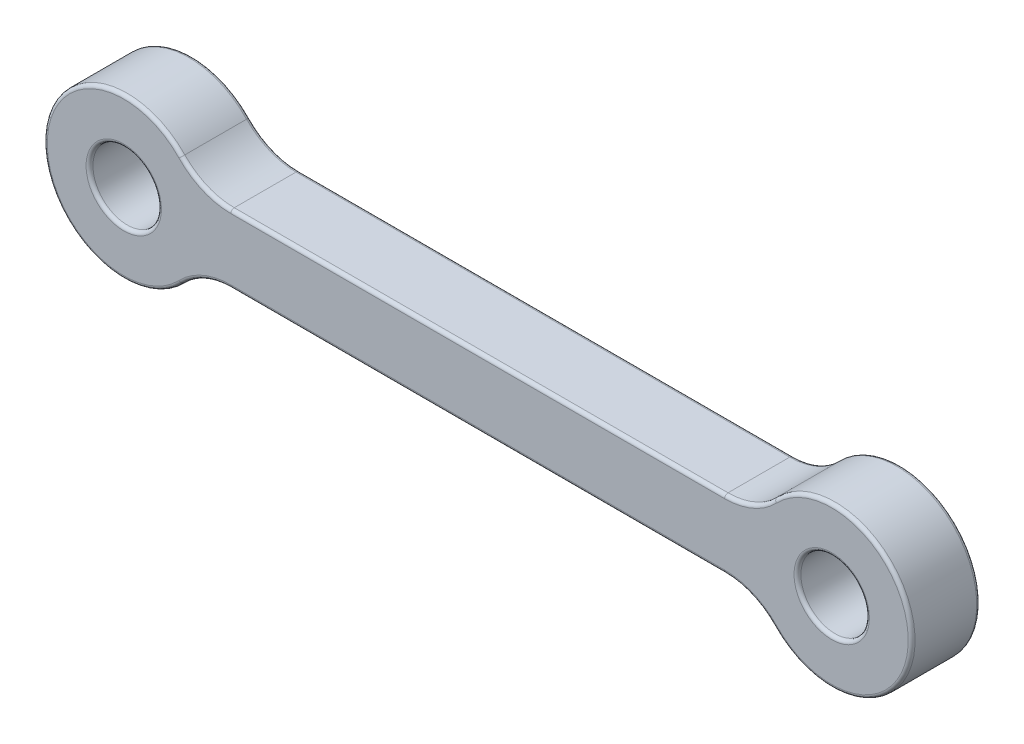
ISO-10303-21;
HEADER;
FILE_DESCRIPTION(('STEP AP214'),'2;1');
FILE_NAME('part.step','',(''),(''),'','','');
FILE_SCHEMA(('AUTOMOTIVE_DESIGN { 1 0 10303 214 1 1 1 1 }'));
ENDSEC;
DATA;
#1=APPLICATION_CONTEXT('core data for automotive mechanical design processes');
#2=APPLICATION_PROTOCOL_DEFINITION('international standard','automotive_design',2000,#1);
#3=PRODUCT_CONTEXT('',#1,'mechanical');
#4=PRODUCT('Part','Part','',(#3));
#5=PRODUCT_RELATED_PRODUCT_CATEGORY('part','',(#4));
#6=PRODUCT_DEFINITION_FORMATION('','',#4);
#7=PRODUCT_DEFINITION_CONTEXT('part definition',#1,'design');
#8=PRODUCT_DEFINITION('design','',#6,#7);
#9=PRODUCT_DEFINITION_SHAPE('','',#8);
#10=(LENGTH_UNIT() NAMED_UNIT(*) SI_UNIT(.MILLI.,.METRE.));
#11=(NAMED_UNIT(*) PLANE_ANGLE_UNIT() SI_UNIT($,.RADIAN.));
#12=(NAMED_UNIT(*) SI_UNIT($,.STERADIAN.) SOLID_ANGLE_UNIT());
#13=UNCERTAINTY_MEASURE_WITH_UNIT(LENGTH_MEASURE(1.E-05),#10,'distance_accuracy_value','');
#14=(GEOMETRIC_REPRESENTATION_CONTEXT(3) GLOBAL_UNCERTAINTY_ASSIGNED_CONTEXT((#13)) GLOBAL_UNIT_ASSIGNED_CONTEXT((#10,
#11,#12)) REPRESENTATION_CONTEXT('',''));
#15=CARTESIAN_POINT('',(0.,0.,0.));
#16=DIRECTION('',(0.,0.,1.));
#17=DIRECTION('',(1.,0.,0.));
#18=AXIS2_PLACEMENT_3D('',#15,#16,#17);
#19=CARTESIAN_POINT('',(0.,0.,1.5));
#20=DIRECTION('',(0.,0.,-1.));
#21=DIRECTION('',(-1.,0.,0.));
#22=AXIS2_PLACEMENT_3D('',#19,#20,#21);
#23=CYLINDRICAL_SURFACE('',#22,3.5);
#24=DIRECTION('',(0.,0.,-1.));
#25=VECTOR('',#24,1.);
#26=CARTESIAN_POINT('',(2.52560848605877,-2.42307692307692,1.5));
#27=LINE('',#26,#25);
#28=CARTESIAN_POINT('',(2.52560848605877,-2.42307692307692,-1.35));
#29=VERTEX_POINT('',#28);
#30=CARTESIAN_POINT('',(2.52560848605877,-2.42307692307692,1.35));
#31=VERTEX_POINT('',#30);
#32=EDGE_CURVE('E402',#29,#31,#27,.F.);
#33=ORIENTED_EDGE('',*,*,#32,.T.);
#34=CARTESIAN_POINT('',(0.,0.,1.35));
#35=DIRECTION('',(0.,0.,1.));
#36=DIRECTION('',(1.,0.,0.));
#37=AXIS2_PLACEMENT_3D('',#34,#35,#36);
#38=CIRCLE('',#37,3.5);
#39=CARTESIAN_POINT('',(2.52560848605877,2.42307692307692,1.35));
#40=VERTEX_POINT('',#39);
#41=EDGE_CURVE('E238',#31,#40,#38,.F.);
#42=ORIENTED_EDGE('',*,*,#41,.T.);
#43=DIRECTION('',(0.,0.,-1.));
#44=VECTOR('',#43,1.);
#45=CARTESIAN_POINT('',(2.52560848605877,2.42307692307692,1.5));
#46=LINE('',#45,#44);
#47=CARTESIAN_POINT('',(2.52560848605877,2.42307692307692,-1.35));
#48=VERTEX_POINT('',#47);
#49=EDGE_CURVE('E405',#40,#48,#46,.T.);
#50=ORIENTED_EDGE('',*,*,#49,.T.);
#51=CARTESIAN_POINT('',(0.,0.,-1.35));
#52=DIRECTION('',(0.,0.,1.));
#53=DIRECTION('',(1.,0.,0.));
#54=AXIS2_PLACEMENT_3D('',#51,#52,#53);
#55=CIRCLE('',#54,3.5);
#56=EDGE_CURVE('E235',#48,#29,#55,.T.);
#57=ORIENTED_EDGE('',*,*,#56,.T.);
#58=EDGE_LOOP('',(#33,#42,#50,#57));
#59=FACE_BOUND('',#58,.T.);
#60=ADVANCED_FACE('F41',(#59),#23,.T.);
#61=CARTESIAN_POINT('',(0.,-1.5,1.5));
#62=DIRECTION('',(0.,-1.,0.));
#63=DIRECTION('',(0.,0.,-1.));
#64=AXIS2_PLACEMENT_3D('',#61,#62,#63);
#65=PLANE('',#64);
#66=DIRECTION('',(0.,0.,1.));
#67=VECTOR('',#66,1.);
#68=CARTESIAN_POINT('',(26.3095842401766,-1.5,1.5));
#69=LINE('',#68,#67);
#70=CARTESIAN_POINT('',(26.3095842401766,-1.5,-1.35));
#71=VERTEX_POINT('',#70);
#72=CARTESIAN_POINT('',(26.3095842401766,-1.5,1.35));
#73=VERTEX_POINT('',#72);
#74=EDGE_CURVE('E310',#71,#73,#69,.T.);
#75=ORIENTED_EDGE('',*,*,#74,.T.);
#76=DIRECTION('',(-1.,0.,0.));
#77=VECTOR('',#76,1.);
#78=CARTESIAN_POINT('',(0.,-1.5,1.35));
#79=LINE('',#78,#77);
#80=CARTESIAN_POINT('',(4.69041575982343,-1.5,1.35));
#81=VERTEX_POINT('',#80);
#82=EDGE_CURVE('E225',#73,#81,#79,.T.);
#83=ORIENTED_EDGE('',*,*,#82,.T.);
#84=DIRECTION('',(0.,0.,-1.));
#85=VECTOR('',#84,1.);
#86=CARTESIAN_POINT('',(4.69041575982343,-1.5,1.5));
#87=LINE('',#86,#85);
#88=CARTESIAN_POINT('',(4.69041575982343,-1.5,-1.35));
#89=VERTEX_POINT('',#88);
#90=EDGE_CURVE('E411',#81,#89,#87,.T.);
#91=ORIENTED_EDGE('',*,*,#90,.T.);
#92=DIRECTION('',(-1.,0.,0.));
#93=VECTOR('',#92,1.);
#94=CARTESIAN_POINT('',(26.3095842401766,-1.5,-1.35));
#95=LINE('',#94,#93);
#96=EDGE_CURVE('E222',#89,#71,#95,.F.);
#97=ORIENTED_EDGE('',*,*,#96,.T.);
#98=EDGE_LOOP('',(#75,#83,#91,#97));
#99=FACE_BOUND('',#98,.T.);
#100=ADVANCED_FACE('F420',(#99),#65,.T.);
#101=CARTESIAN_POINT('',(31.,0.,1.5));
#102=DIRECTION('',(0.,0.,-1.));
#103=DIRECTION('',(-1.,0.,0.));
#104=AXIS2_PLACEMENT_3D('',#101,#102,#103);
#105=CYLINDRICAL_SURFACE('',#104,3.5);
#106=DIRECTION('',(0.,0.,-1.));
#107=VECTOR('',#106,1.);
#108=CARTESIAN_POINT('',(28.4743915139412,2.42307692307692,1.5));
#109=LINE('',#108,#107);
#110=CARTESIAN_POINT('',(28.4743915139412,2.42307692307692,-1.35));
#111=VERTEX_POINT('',#110);
#112=CARTESIAN_POINT('',(28.4743915139412,2.42307692307692,1.35));
#113=VERTEX_POINT('',#112);
#114=EDGE_CURVE('E358',#111,#113,#109,.F.);
#115=ORIENTED_EDGE('',*,*,#114,.T.);
#116=CARTESIAN_POINT('',(31.,0.,1.35));
#117=DIRECTION('',(0.,0.,1.));
#118=DIRECTION('',(1.,0.,0.));
#119=AXIS2_PLACEMENT_3D('',#116,#117,#118);
#120=CIRCLE('',#119,3.5);
#121=CARTESIAN_POINT('',(28.4743915139412,-2.42307692307692,1.35));
#122=VERTEX_POINT('',#121);
#123=EDGE_CURVE('E213',#113,#122,#120,.F.);
#124=ORIENTED_EDGE('',*,*,#123,.T.);
#125=DIRECTION('',(0.,0.,-1.));
#126=VECTOR('',#125,1.);
#127=CARTESIAN_POINT('',(28.4743915139412,-2.42307692307692,1.5));
#128=LINE('',#127,#126);
#129=CARTESIAN_POINT('',(28.4743915139412,-2.42307692307692,-1.35));
#130=VERTEX_POINT('',#129);
#131=EDGE_CURVE('E365',#122,#130,#128,.T.);
#132=ORIENTED_EDGE('',*,*,#131,.T.);
#133=CARTESIAN_POINT('',(31.,0.,-1.35));
#134=DIRECTION('',(0.,0.,1.));
#135=DIRECTION('',(1.,0.,0.));
#136=AXIS2_PLACEMENT_3D('',#133,#134,#135);
#137=CIRCLE('',#136,3.5);
#138=EDGE_CURVE('E210',#130,#111,#137,.T.);
#139=ORIENTED_EDGE('',*,*,#138,.T.);
#140=EDGE_LOOP('',(#115,#124,#132,#139));
#141=FACE_BOUND('',#140,.T.);
#142=ADVANCED_FACE('F400',(#141),#105,.T.);
#143=CARTESIAN_POINT('',(0.,1.5,1.5));
#144=DIRECTION('',(0.,-1.,0.));
#145=DIRECTION('',(0.,0.,-1.));
#146=AXIS2_PLACEMENT_3D('',#143,#144,#145);
#147=PLANE('',#146);
#148=DIRECTION('',(0.,0.,1.));
#149=VECTOR('',#148,1.);
#150=CARTESIAN_POINT('',(4.69041575982343,1.5,1.5));
#151=LINE('',#150,#149);
#152=CARTESIAN_POINT('',(4.69041575982343,1.5,-1.35));
#153=VERTEX_POINT('',#152);
#154=CARTESIAN_POINT('',(4.69041575982343,1.5,1.35));
#155=VERTEX_POINT('',#154);
#156=EDGE_CURVE('E364',#153,#155,#151,.T.);
#157=ORIENTED_EDGE('',*,*,#156,.T.);
#158=DIRECTION('',(-1.,0.,0.));
#159=VECTOR('',#158,1.);
#160=CARTESIAN_POINT('',(26.3095842401766,1.5,1.35));
#161=LINE('',#160,#159);
#162=CARTESIAN_POINT('',(26.3095842401766,1.5,1.35));
#163=VERTEX_POINT('',#162);
#164=EDGE_CURVE('E250',#155,#163,#161,.F.);
#165=ORIENTED_EDGE('',*,*,#164,.T.);
#166=DIRECTION('',(0.,0.,-1.));
#167=VECTOR('',#166,1.);
#168=CARTESIAN_POINT('',(26.3095842401766,1.5,1.5));
#169=LINE('',#168,#167);
#170=CARTESIAN_POINT('',(26.3095842401766,1.5,-1.35));
#171=VERTEX_POINT('',#170);
#172=EDGE_CURVE('E356',#163,#171,#169,.T.);
#173=ORIENTED_EDGE('',*,*,#172,.T.);
#174=DIRECTION('',(-1.,0.,0.));
#175=VECTOR('',#174,1.);
#176=CARTESIAN_POINT('',(0.,1.5,-1.35));
#177=LINE('',#176,#175);
#178=EDGE_CURVE('E247',#171,#153,#177,.T.);
#179=ORIENTED_EDGE('',*,*,#178,.T.);
#180=EDGE_LOOP('',(#157,#165,#173,#179));
#181=FACE_BOUND('',#180,.T.);
#182=ADVANCED_FACE('F361',(#181),#147,.F.);
#183=CARTESIAN_POINT('',(0.,0.,1.5));
#184=DIRECTION('',(0.,0.,-1.));
#185=DIRECTION('',(-1.,0.,0.));
#186=AXIS2_PLACEMENT_3D('',#183,#184,#185);
#187=CYLINDRICAL_SURFACE('',#186,1.5);
#188=CARTESIAN_POINT('',(0.,0.,1.35));
#189=DIRECTION('',(0.,0.,1.));
#190=DIRECTION('',(1.,0.,0.));
#191=AXIS2_PLACEMENT_3D('',#188,#189,#190);
#192=CIRCLE('',#191,1.5);
#193=CARTESIAN_POINT('',(1.5,0.,1.35));
#194=VERTEX_POINT('',#193);
#195=EDGE_CURVE('E257',#194,#194,#192,.T.);
#196=ORIENTED_EDGE('',*,*,#195,.T.);
#197=EDGE_LOOP('',(#196));
#198=FACE_BOUND('',#197,.T.);
#199=CARTESIAN_POINT('',(0.,0.,-1.35));
#200=DIRECTION('',(0.,0.,1.));
#201=DIRECTION('',(1.,0.,0.));
#202=AXIS2_PLACEMENT_3D('',#199,#200,#201);
#203=CIRCLE('',#202,1.5);
#204=CARTESIAN_POINT('',(1.5,0.,-1.35));
#205=VERTEX_POINT('',#204);
#206=EDGE_CURVE('E253',#205,#205,#203,.F.);
#207=ORIENTED_EDGE('',*,*,#206,.T.);
#208=EDGE_LOOP('',(#207));
#209=FACE_BOUND('',#208,.T.);
#210=ADVANCED_FACE('F473',(#198,#209),#187,.F.);
#211=CARTESIAN_POINT('',(31.,0.,1.5));
#212=DIRECTION('',(0.,0.,-1.));
#213=DIRECTION('',(-1.,0.,0.));
#214=AXIS2_PLACEMENT_3D('',#211,#212,#213);
#215=CYLINDRICAL_SURFACE('',#214,1.5);
#216=CARTESIAN_POINT('',(31.,0.,1.35));
#217=DIRECTION('',(0.,0.,1.));
#218=DIRECTION('',(1.,0.,0.));
#219=AXIS2_PLACEMENT_3D('',#216,#217,#218);
#220=CIRCLE('',#219,1.5);
#221=CARTESIAN_POINT('',(32.5,0.,1.35));
#222=VERTEX_POINT('',#221);
#223=EDGE_CURVE('E201',#222,#222,#220,.T.);
#224=ORIENTED_EDGE('',*,*,#223,.T.);
#225=EDGE_LOOP('',(#224));
#226=FACE_BOUND('',#225,.T.);
#227=CARTESIAN_POINT('',(31.,0.,-1.35));
#228=DIRECTION('',(0.,0.,1.));
#229=DIRECTION('',(1.,0.,0.));
#230=AXIS2_PLACEMENT_3D('',#227,#228,#229);
#231=CIRCLE('',#230,1.5);
#232=CARTESIAN_POINT('',(32.5,0.,-1.35));
#233=VERTEX_POINT('',#232);
#234=EDGE_CURVE('E192',#233,#233,#231,.F.);
#235=ORIENTED_EDGE('',*,*,#234,.T.);
#236=EDGE_LOOP('',(#235));
#237=FACE_BOUND('',#236,.T.);
#238=ADVANCED_FACE('F475',(#226,#237),#215,.F.);
#239=CARTESIAN_POINT('',(0.,0.,1.5));
#240=DIRECTION('',(0.,0.,1.));
#241=DIRECTION('',(1.,0.,0.));
#242=AXIS2_PLACEMENT_3D('',#239,#240,#241);
#243=PLANE('',#242);
#244=CARTESIAN_POINT('',(31.,0.,1.5));
#245=DIRECTION('',(0.,0.,1.));
#246=DIRECTION('',(1.,0.,0.));
#247=AXIS2_PLACEMENT_3D('',#244,#245,#246);
#248=CIRCLE('',#247,1.65);
#249=CARTESIAN_POINT('',(32.65,0.,1.5));
#250=VERTEX_POINT('',#249);
#251=EDGE_CURVE('E187',#250,#250,#248,.F.);
#252=ORIENTED_EDGE('',*,*,#251,.T.);
#253=EDGE_LOOP('',(#252));
#254=FACE_BOUND('',#253,.T.);
#255=CARTESIAN_POINT('',(31.,0.,1.5));
#256=DIRECTION('',(0.,0.,1.));
#257=DIRECTION('',(1.,0.,0.));
#258=AXIS2_PLACEMENT_3D('',#255,#256,#257);
#259=CIRCLE('',#258,3.35);
#260=CARTESIAN_POINT('',(28.5826318776295,-2.31923076923077,1.5));
#261=VERTEX_POINT('',#260);
#262=CARTESIAN_POINT('',(28.5826318776295,2.31923076923077,1.5));
#263=VERTEX_POINT('',#262);
#264=EDGE_CURVE('E184',#261,#263,#259,.T.);
#265=ORIENTED_EDGE('',*,*,#264,.T.);
#266=CARTESIAN_POINT('',(26.3095842401766,4.5,1.5));
#267=DIRECTION('',(0.,0.,1.));
#268=DIRECTION('',(1.,0.,0.));
#269=AXIS2_PLACEMENT_3D('',#266,#267,#268);
#270=CIRCLE('',#269,3.15);
#271=CARTESIAN_POINT('',(26.3095842401766,1.35,1.5));
#272=VERTEX_POINT('',#271);
#273=EDGE_CURVE('E162',#263,#272,#270,.F.);
#274=ORIENTED_EDGE('',*,*,#273,.T.);
#275=DIRECTION('',(-1.,0.,0.));
#276=VECTOR('',#275,1.);
#277=CARTESIAN_POINT('',(4.69041575982343,1.35,1.5));
#278=LINE('',#277,#276);
#279=CARTESIAN_POINT('',(4.69041575982343,1.35,1.5));
#280=VERTEX_POINT('',#279);
#281=EDGE_CURVE('E171',#272,#280,#278,.T.);
#282=ORIENTED_EDGE('',*,*,#281,.T.);
#283=CARTESIAN_POINT('',(4.69041575982343,4.5,1.5));
#284=DIRECTION('',(0.,0.,1.));
#285=DIRECTION('',(1.,0.,0.));
#286=AXIS2_PLACEMENT_3D('',#283,#284,#285);
#287=CIRCLE('',#286,3.15);
#288=CARTESIAN_POINT('',(2.41736812237054,2.31923076923077,1.5));
#289=VERTEX_POINT('',#288);
#290=EDGE_CURVE('E178',#280,#289,#287,.F.);
#291=ORIENTED_EDGE('',*,*,#290,.T.);
#292=CARTESIAN_POINT('',(0.,0.,1.5));
#293=DIRECTION('',(0.,0.,1.));
#294=DIRECTION('',(1.,0.,0.));
#295=AXIS2_PLACEMENT_3D('',#292,#293,#294);
#296=CIRCLE('',#295,3.35);
#297=CARTESIAN_POINT('',(2.41736812237054,-2.31923076923077,1.5));
#298=VERTEX_POINT('',#297);
#299=EDGE_CURVE('E379',#289,#298,#296,.T.);
#300=ORIENTED_EDGE('',*,*,#299,.T.);
#301=CARTESIAN_POINT('',(4.69041575982343,-4.5,1.5));
#302=DIRECTION('',(0.,0.,1.));
#303=DIRECTION('',(1.,0.,0.));
#304=AXIS2_PLACEMENT_3D('',#301,#302,#303);
#305=CIRCLE('',#304,3.15);
#306=CARTESIAN_POINT('',(4.69041575982343,-1.35,1.5));
#307=VERTEX_POINT('',#306);
#308=EDGE_CURVE('E382',#298,#307,#305,.F.);
#309=ORIENTED_EDGE('',*,*,#308,.T.);
#310=DIRECTION('',(-1.,0.,0.));
#311=VECTOR('',#310,1.);
#312=CARTESIAN_POINT('',(0.,-1.35,1.5));
#313=LINE('',#312,#311);
#314=CARTESIAN_POINT('',(26.3095842401766,-1.35,1.5));
#315=VERTEX_POINT('',#314);
#316=EDGE_CURVE('E385',#307,#315,#313,.F.);
#317=ORIENTED_EDGE('',*,*,#316,.T.);
#318=CARTESIAN_POINT('',(26.3095842401766,-4.5,1.5));
#319=DIRECTION('',(0.,0.,1.));
#320=DIRECTION('',(1.,0.,0.));
#321=AXIS2_PLACEMENT_3D('',#318,#319,#320);
#322=CIRCLE('',#321,3.15);
#323=EDGE_CURVE('E194',#315,#261,#322,.F.);
#324=ORIENTED_EDGE('',*,*,#323,.T.);
#325=EDGE_LOOP('',(#265,#274,#282,#291,#300,#309,#317,#324));
#326=FACE_BOUND('',#325,.T.);
#327=CARTESIAN_POINT('',(0.,0.,1.5));
#328=DIRECTION('',(0.,0.,1.));
#329=DIRECTION('',(1.,0.,0.));
#330=AXIS2_PLACEMENT_3D('',#327,#328,#329);
#331=CIRCLE('',#330,1.65);
#332=CARTESIAN_POINT('',(1.65,0.,1.5));
#333=VERTEX_POINT('',#332);
#334=EDGE_CURVE('E179',#333,#333,#331,.F.);
#335=ORIENTED_EDGE('',*,*,#334,.T.);
#336=EDGE_LOOP('',(#335));
#337=FACE_BOUND('',#336,.T.);
#338=ADVANCED_FACE('F181',(#254,#326,#337),#243,.T.);
#339=CARTESIAN_POINT('',(0.,0.,-1.5));
#340=DIRECTION('',(0.,0.,1.));
#341=DIRECTION('',(1.,0.,0.));
#342=AXIS2_PLACEMENT_3D('',#339,#340,#341);
#343=PLANE('',#342);
#344=CARTESIAN_POINT('',(31.,0.,-1.5));
#345=DIRECTION('',(0.,0.,1.));
#346=DIRECTION('',(1.,0.,0.));
#347=AXIS2_PLACEMENT_3D('',#344,#345,#346);
#348=CIRCLE('',#347,1.65);
#349=CARTESIAN_POINT('',(32.65,0.,-1.5));
#350=VERTEX_POINT('',#349);
#351=EDGE_CURVE('E11',#350,#350,#348,.T.);
#352=ORIENTED_EDGE('',*,*,#351,.T.);
#353=EDGE_LOOP('',(#352));
#354=FACE_BOUND('',#353,.T.);
#355=DIRECTION('',(-1.,0.,0.));
#356=VECTOR('',#355,1.);
#357=CARTESIAN_POINT('',(4.69041575982343,-1.35,-1.5));
#358=LINE('',#357,#356);
#359=CARTESIAN_POINT('',(26.3095842401766,-1.35,-1.5));
#360=VERTEX_POINT('',#359);
#361=CARTESIAN_POINT('',(4.69041575982343,-1.35,-1.5));
#362=VERTEX_POINT('',#361);
#363=EDGE_CURVE('E59',#360,#362,#358,.T.);
#364=ORIENTED_EDGE('',*,*,#363,.T.);
#365=CARTESIAN_POINT('',(4.69041575982343,-4.5,-1.5));
#366=DIRECTION('',(0.,0.,1.));
#367=DIRECTION('',(1.,0.,0.));
#368=AXIS2_PLACEMENT_3D('',#365,#366,#367);
#369=CIRCLE('',#368,3.15);
#370=CARTESIAN_POINT('',(2.41736812237054,-2.31923076923077,-1.5));
#371=VERTEX_POINT('',#370);
#372=EDGE_CURVE('E51',#362,#371,#369,.T.);
#373=ORIENTED_EDGE('',*,*,#372,.T.);
#374=CARTESIAN_POINT('',(0.,0.,-1.5));
#375=DIRECTION('',(0.,0.,1.));
#376=DIRECTION('',(1.,0.,0.));
#377=AXIS2_PLACEMENT_3D('',#374,#375,#376);
#378=CIRCLE('',#377,3.35);
#379=CARTESIAN_POINT('',(2.41736812237054,2.31923076923077,-1.5));
#380=VERTEX_POINT('',#379);
#381=EDGE_CURVE('E265',#371,#380,#378,.F.);
#382=ORIENTED_EDGE('',*,*,#381,.T.);
#383=CARTESIAN_POINT('',(4.69041575982343,4.5,-1.5));
#384=DIRECTION('',(0.,0.,1.));
#385=DIRECTION('',(1.,0.,0.));
#386=AXIS2_PLACEMENT_3D('',#383,#384,#385);
#387=CIRCLE('',#386,3.15);
#388=CARTESIAN_POINT('',(4.69041575982343,1.35,-1.5));
#389=VERTEX_POINT('',#388);
#390=EDGE_CURVE('E268',#380,#389,#387,.T.);
#391=ORIENTED_EDGE('',*,*,#390,.T.);
#392=DIRECTION('',(-1.,0.,0.));
#393=VECTOR('',#392,1.);
#394=CARTESIAN_POINT('',(0.,1.35,-1.5));
#395=LINE('',#394,#393);
#396=CARTESIAN_POINT('',(26.3095842401766,1.35,-1.5));
#397=VERTEX_POINT('',#396);
#398=EDGE_CURVE('E271',#389,#397,#395,.F.);
#399=ORIENTED_EDGE('',*,*,#398,.T.);
#400=CARTESIAN_POINT('',(26.3095842401766,4.5,-1.5));
#401=DIRECTION('',(0.,0.,1.));
#402=DIRECTION('',(1.,0.,0.));
#403=AXIS2_PLACEMENT_3D('',#400,#401,#402);
#404=CIRCLE('',#403,3.15);
#405=CARTESIAN_POINT('',(28.5826318776295,2.31923076923077,-1.5));
#406=VERTEX_POINT('',#405);
#407=EDGE_CURVE('E274',#397,#406,#404,.T.);
#408=ORIENTED_EDGE('',*,*,#407,.T.);
#409=CARTESIAN_POINT('',(31.,0.,-1.5));
#410=DIRECTION('',(0.,0.,1.));
#411=DIRECTION('',(1.,0.,0.));
#412=AXIS2_PLACEMENT_3D('',#409,#410,#411);
#413=CIRCLE('',#412,3.35);
#414=CARTESIAN_POINT('',(28.5826318776295,-2.31923076923077,-1.5));
#415=VERTEX_POINT('',#414);
#416=EDGE_CURVE('E277',#406,#415,#413,.F.);
#417=ORIENTED_EDGE('',*,*,#416,.T.);
#418=CARTESIAN_POINT('',(26.3095842401766,-4.5,-1.5));
#419=DIRECTION('',(0.,0.,1.));
#420=DIRECTION('',(1.,0.,0.));
#421=AXIS2_PLACEMENT_3D('',#418,#419,#420);
#422=CIRCLE('',#421,3.15);
#423=EDGE_CURVE('E64',#415,#360,#422,.T.);
#424=ORIENTED_EDGE('',*,*,#423,.T.);
#425=EDGE_LOOP('',(#364,#373,#382,#391,#399,#408,#417,#424));
#426=FACE_BOUND('',#425,.T.);
#427=CARTESIAN_POINT('',(0.,0.,-1.5));
#428=DIRECTION('',(0.,0.,1.));
#429=DIRECTION('',(1.,0.,0.));
#430=AXIS2_PLACEMENT_3D('',#427,#428,#429);
#431=CIRCLE('',#430,1.65);
#432=CARTESIAN_POINT('',(1.65,0.,-1.5));
#433=VERTEX_POINT('',#432);
#434=EDGE_CURVE('E261',#433,#433,#431,.T.);
#435=ORIENTED_EDGE('',*,*,#434,.T.);
#436=EDGE_LOOP('',(#435));
#437=FACE_BOUND('',#436,.T.);
#438=ADVANCED_FACE('F463',(#354,#426,#437),#343,.F.);
#439=CARTESIAN_POINT('',(4.69041575982343,-4.5,1.5));
#440=DIRECTION('',(0.,0.,-1.));
#441=DIRECTION('',(-1.,0.,0.));
#442=AXIS2_PLACEMENT_3D('',#439,#440,#441);
#443=CYLINDRICAL_SURFACE('',#442,3.);
#444=ORIENTED_EDGE('',*,*,#90,.F.);
#445=CARTESIAN_POINT('',(4.69041575982343,-4.5,1.35));
#446=DIRECTION('',(0.,0.,1.));
#447=DIRECTION('',(1.,0.,0.));
#448=AXIS2_PLACEMENT_3D('',#445,#446,#447);
#449=CIRCLE('',#448,3.);
#450=EDGE_CURVE('E232',#81,#31,#449,.T.);
#451=ORIENTED_EDGE('',*,*,#450,.T.);
#452=ORIENTED_EDGE('',*,*,#32,.F.);
#453=CARTESIAN_POINT('',(4.69041575982343,-4.5,-1.35));
#454=DIRECTION('',(0.,0.,1.));
#455=DIRECTION('',(1.,0.,0.));
#456=AXIS2_PLACEMENT_3D('',#453,#454,#455);
#457=CIRCLE('',#456,3.);
#458=EDGE_CURVE('E228',#29,#89,#457,.F.);
#459=ORIENTED_EDGE('',*,*,#458,.T.);
#460=EDGE_LOOP('',(#444,#451,#452,#459));
#461=FACE_BOUND('',#460,.T.);
#462=ADVANCED_FACE('F436',(#461),#443,.F.);
#463=CARTESIAN_POINT('',(26.3095842401766,-4.5,1.5));
#464=DIRECTION('',(0.,0.,-1.));
#465=DIRECTION('',(-1.,0.,0.));
#466=AXIS2_PLACEMENT_3D('',#463,#464,#465);
#467=CYLINDRICAL_SURFACE('',#466,3.);
#468=ORIENTED_EDGE('',*,*,#131,.F.);
#469=CARTESIAN_POINT('',(26.3095842401766,-4.5,1.35));
#470=DIRECTION('',(0.,0.,1.));
#471=DIRECTION('',(1.,0.,0.));
#472=AXIS2_PLACEMENT_3D('',#469,#470,#471);
#473=CIRCLE('',#472,3.);
#474=EDGE_CURVE('E219',#122,#73,#473,.T.);
#475=ORIENTED_EDGE('',*,*,#474,.T.);
#476=ORIENTED_EDGE('',*,*,#74,.F.);
#477=CARTESIAN_POINT('',(26.3095842401766,-4.5,-1.35));
#478=DIRECTION('',(0.,0.,1.));
#479=DIRECTION('',(1.,0.,0.));
#480=AXIS2_PLACEMENT_3D('',#477,#478,#479);
#481=CIRCLE('',#480,3.);
#482=EDGE_CURVE('E216',#71,#130,#481,.F.);
#483=ORIENTED_EDGE('',*,*,#482,.T.);
#484=EDGE_LOOP('',(#468,#475,#476,#483));
#485=FACE_BOUND('',#484,.T.);
#486=ADVANCED_FACE('F453',(#485),#467,.F.);
#487=CARTESIAN_POINT('',(4.69041575982343,4.5,1.5));
#488=DIRECTION('',(0.,0.,-1.));
#489=DIRECTION('',(-1.,0.,0.));
#490=AXIS2_PLACEMENT_3D('',#487,#488,#489);
#491=CYLINDRICAL_SURFACE('',#490,3.);
#492=ORIENTED_EDGE('',*,*,#49,.F.);
#493=CARTESIAN_POINT('',(4.69041575982343,4.5,1.35));
#494=DIRECTION('',(0.,0.,1.));
#495=DIRECTION('',(1.,0.,0.));
#496=AXIS2_PLACEMENT_3D('',#493,#494,#495);
#497=CIRCLE('',#496,3.);
#498=EDGE_CURVE('E244',#40,#155,#497,.T.);
#499=ORIENTED_EDGE('',*,*,#498,.T.);
#500=ORIENTED_EDGE('',*,*,#156,.F.);
#501=CARTESIAN_POINT('',(4.69041575982343,4.5,-1.35));
#502=DIRECTION('',(0.,0.,1.));
#503=DIRECTION('',(1.,0.,0.));
#504=AXIS2_PLACEMENT_3D('',#501,#502,#503);
#505=CIRCLE('',#504,3.);
#506=EDGE_CURVE('E241',#153,#48,#505,.F.);
#507=ORIENTED_EDGE('',*,*,#506,.T.);
#508=EDGE_LOOP('',(#492,#499,#500,#507));
#509=FACE_BOUND('',#508,.T.);
#510=ADVANCED_FACE('F455',(#509),#491,.F.);
#511=CARTESIAN_POINT('',(26.3095842401766,4.5,1.5));
#512=DIRECTION('',(0.,0.,-1.));
#513=DIRECTION('',(-1.,0.,0.));
#514=AXIS2_PLACEMENT_3D('',#511,#512,#513);
#515=CYLINDRICAL_SURFACE('',#514,3.);
#516=ORIENTED_EDGE('',*,*,#172,.F.);
#517=CARTESIAN_POINT('',(26.3095842401766,4.5,1.35));
#518=DIRECTION('',(0.,0.,1.));
#519=DIRECTION('',(1.,0.,0.));
#520=AXIS2_PLACEMENT_3D('',#517,#518,#519);
#521=CIRCLE('',#520,3.);
#522=EDGE_CURVE('E164',#163,#113,#521,.T.);
#523=ORIENTED_EDGE('',*,*,#522,.T.);
#524=ORIENTED_EDGE('',*,*,#114,.F.);
#525=CARTESIAN_POINT('',(26.3095842401766,4.5,-1.35));
#526=DIRECTION('',(0.,0.,1.));
#527=DIRECTION('',(1.,0.,0.));
#528=AXIS2_PLACEMENT_3D('',#525,#526,#527);
#529=CIRCLE('',#528,3.);
#530=EDGE_CURVE('E205',#111,#171,#529,.F.);
#531=ORIENTED_EDGE('',*,*,#530,.T.);
#532=EDGE_LOOP('',(#516,#523,#524,#531));
#533=FACE_BOUND('',#532,.T.);
#534=ADVANCED_FACE('F355',(#533),#515,.F.);
#535=CARTESIAN_POINT('',(31.,0.,1.35));
#536=DIRECTION('',(0.,0.,1.));
#537=DIRECTION('',(1.,0.,0.));
#538=AXIS2_PLACEMENT_3D('',#535,#536,#537);
#539=TOROIDAL_SURFACE('',#538,1.65,0.15);
#540=ORIENTED_EDGE('',*,*,#223,.F.);
#541=EDGE_LOOP('',(#540));
#542=FACE_BOUND('',#541,.T.);
#543=ORIENTED_EDGE('',*,*,#251,.F.);
#544=EDGE_LOOP('',(#543));
#545=FACE_BOUND('',#544,.T.);
#546=ADVANCED_FACE('F558',(#542,#545),#539,.T.);
#547=CARTESIAN_POINT('',(4.69041575982343,-4.5,1.35));
#548=DIRECTION('',(0.,0.,1.));
#549=DIRECTION('',(1.,0.,0.));
#550=AXIS2_PLACEMENT_3D('',#547,#548,#549);
#551=TOROIDAL_SURFACE('',#550,3.15,0.15);
#552=CARTESIAN_POINT('',(2.41736812237054,-2.31923076923077,1.35));
#553=DIRECTION('',(-0.692307692307693,-0.72160242458822,0.));
#554=DIRECTION('',(0.72160242458822,-0.692307692307693,0.));
#555=AXIS2_PLACEMENT_3D('',#552,#553,#554);
#556=CIRCLE('',#555,0.15);
#557=EDGE_CURVE('E302',#31,#298,#556,.T.);
#558=ORIENTED_EDGE('',*,*,#557,.F.);
#559=ORIENTED_EDGE('',*,*,#450,.F.);
#560=CARTESIAN_POINT('',(4.69041575982343,-1.35,1.35));
#561=DIRECTION('',(1.,0.,0.));
#562=DIRECTION('',(0.,0.,-1.));
#563=AXIS2_PLACEMENT_3D('',#560,#561,#562);
#564=CIRCLE('',#563,0.15);
#565=EDGE_CURVE('E306',#307,#81,#564,.T.);
#566=ORIENTED_EDGE('',*,*,#565,.F.);
#567=ORIENTED_EDGE('',*,*,#308,.F.);
#568=EDGE_LOOP('',(#558,#559,#566,#567));
#569=FACE_BOUND('',#568,.T.);
#570=ADVANCED_FACE('F432',(#569),#551,.T.);
#571=CARTESIAN_POINT('',(0.,-1.35,1.35));
#572=DIRECTION('',(-1.,0.,0.));
#573=DIRECTION('',(0.,0.,1.));
#574=AXIS2_PLACEMENT_3D('',#571,#572,#573);
#575=CYLINDRICAL_SURFACE('',#574,0.15);
#576=ORIENTED_EDGE('',*,*,#565,.T.);
#577=ORIENTED_EDGE('',*,*,#82,.F.);
#578=CARTESIAN_POINT('',(26.3095842401766,-1.35,1.35));
#579=DIRECTION('',(1.,0.,0.));
#580=DIRECTION('',(0.,0.,-1.));
#581=AXIS2_PLACEMENT_3D('',#578,#579,#580);
#582=CIRCLE('',#581,0.15);
#583=EDGE_CURVE('E298',#315,#73,#582,.T.);
#584=ORIENTED_EDGE('',*,*,#583,.F.);
#585=ORIENTED_EDGE('',*,*,#316,.F.);
#586=EDGE_LOOP('',(#576,#577,#584,#585));
#587=FACE_BOUND('',#586,.T.);
#588=ADVANCED_FACE('F426',(#587),#575,.T.);
#589=CARTESIAN_POINT('',(0.,0.,1.35));
#590=DIRECTION('',(0.,0.,1.));
#591=DIRECTION('',(1.,0.,0.));
#592=AXIS2_PLACEMENT_3D('',#589,#590,#591);
#593=TOROIDAL_SURFACE('',#592,3.35,0.15);
#594=ORIENTED_EDGE('',*,*,#557,.T.);
#595=ORIENTED_EDGE('',*,*,#299,.F.);
#596=CARTESIAN_POINT('',(2.41736812237054,2.31923076923077,1.35));
#597=DIRECTION('',(0.692307692307693,-0.72160242458822,0.));
#598=DIRECTION('',(0.72160242458822,0.692307692307693,0.));
#599=AXIS2_PLACEMENT_3D('',#596,#597,#598);
#600=CIRCLE('',#599,0.15);
#601=EDGE_CURVE('E294',#40,#289,#600,.T.);
#602=ORIENTED_EDGE('',*,*,#601,.F.);
#603=ORIENTED_EDGE('',*,*,#41,.F.);
#604=EDGE_LOOP('',(#594,#595,#602,#603));
#605=FACE_BOUND('',#604,.T.);
#606=ADVANCED_FACE('F584',(#605),#593,.T.);
#607=CARTESIAN_POINT('',(26.3095842401766,-4.5,1.35));
#608=DIRECTION('',(0.,0.,1.));
#609=DIRECTION('',(1.,0.,0.));
#610=AXIS2_PLACEMENT_3D('',#607,#608,#609);
#611=TOROIDAL_SURFACE('',#610,3.15,0.15);
#612=ORIENTED_EDGE('',*,*,#583,.T.);
#613=ORIENTED_EDGE('',*,*,#474,.F.);
#614=CARTESIAN_POINT('',(28.5826318776295,-2.31923076923077,1.35));
#615=DIRECTION('',(0.6923076923077,-0.721602424588213,0.));
#616=DIRECTION('',(0.721602424588213,0.6923076923077,0.));
#617=AXIS2_PLACEMENT_3D('',#614,#615,#616);
#618=CIRCLE('',#617,0.15);
#619=EDGE_CURVE('E290',#261,#122,#618,.T.);
#620=ORIENTED_EDGE('',*,*,#619,.F.);
#621=ORIENTED_EDGE('',*,*,#323,.F.);
#622=EDGE_LOOP('',(#612,#613,#620,#621));
#623=FACE_BOUND('',#622,.T.);
#624=ADVANCED_FACE('F394',(#623),#611,.T.);
#625=CARTESIAN_POINT('',(4.69041575982343,4.5,1.35));
#626=DIRECTION('',(0.,0.,1.));
#627=DIRECTION('',(1.,0.,0.));
#628=AXIS2_PLACEMENT_3D('',#625,#626,#627);
#629=TOROIDAL_SURFACE('',#628,3.15,0.15);
#630=ORIENTED_EDGE('',*,*,#601,.T.);
#631=ORIENTED_EDGE('',*,*,#290,.F.);
#632=CARTESIAN_POINT('',(4.69041575982343,1.35,1.35));
#633=DIRECTION('',(1.,0.,0.));
#634=DIRECTION('',(0.,0.,-1.));
#635=AXIS2_PLACEMENT_3D('',#632,#633,#634);
#636=CIRCLE('',#635,0.15);
#637=EDGE_CURVE('E174',#155,#280,#636,.T.);
#638=ORIENTED_EDGE('',*,*,#637,.F.);
#639=ORIENTED_EDGE('',*,*,#498,.F.);
#640=EDGE_LOOP('',(#630,#631,#638,#639));
#641=FACE_BOUND('',#640,.T.);
#642=ADVANCED_FACE('F602',(#641),#629,.T.);
#643=CARTESIAN_POINT('',(31.,0.,1.35));
#644=DIRECTION('',(0.,0.,1.));
#645=DIRECTION('',(1.,0.,0.));
#646=AXIS2_PLACEMENT_3D('',#643,#644,#645);
#647=TOROIDAL_SURFACE('',#646,3.35,0.15);
#648=ORIENTED_EDGE('',*,*,#619,.T.);
#649=ORIENTED_EDGE('',*,*,#123,.F.);
#650=CARTESIAN_POINT('',(28.5826318776295,2.31923076923077,1.35));
#651=DIRECTION('',(-0.692307692307698,-0.721602424588214,0.));
#652=DIRECTION('',(0.721602424588214,-0.692307692307698,0.));
#653=AXIS2_PLACEMENT_3D('',#650,#651,#652);
#654=CIRCLE('',#653,0.15);
#655=EDGE_CURVE('E168',#263,#113,#654,.T.);
#656=ORIENTED_EDGE('',*,*,#655,.F.);
#657=ORIENTED_EDGE('',*,*,#264,.F.);
#658=EDGE_LOOP('',(#648,#649,#656,#657));
#659=FACE_BOUND('',#658,.T.);
#660=ADVANCED_FACE('F397',(#659),#647,.T.);
#661=CARTESIAN_POINT('',(0.,1.35,1.35));
#662=DIRECTION('',(1.,0.,0.));
#663=DIRECTION('',(0.,0.,-1.));
#664=AXIS2_PLACEMENT_3D('',#661,#662,#663);
#665=CYLINDRICAL_SURFACE('',#664,0.15);
#666=ORIENTED_EDGE('',*,*,#637,.T.);
#667=ORIENTED_EDGE('',*,*,#281,.F.);
#668=CARTESIAN_POINT('',(26.3095842401766,1.35,1.35));
#669=DIRECTION('',(1.,0.,0.));
#670=DIRECTION('',(0.,0.,-1.));
#671=AXIS2_PLACEMENT_3D('',#668,#669,#670);
#672=CIRCLE('',#671,0.15);
#673=EDGE_CURVE('E158',#163,#272,#672,.T.);
#674=ORIENTED_EDGE('',*,*,#673,.F.);
#675=ORIENTED_EDGE('',*,*,#164,.F.);
#676=EDGE_LOOP('',(#666,#667,#674,#675));
#677=FACE_BOUND('',#676,.T.);
#678=ADVANCED_FACE('F172',(#677),#665,.T.);
#679=CARTESIAN_POINT('',(26.3095842401766,4.5,1.35));
#680=DIRECTION('',(0.,0.,1.));
#681=DIRECTION('',(1.,0.,0.));
#682=AXIS2_PLACEMENT_3D('',#679,#680,#681);
#683=TOROIDAL_SURFACE('',#682,3.15,0.15);
#684=ORIENTED_EDGE('',*,*,#655,.T.);
#685=ORIENTED_EDGE('',*,*,#522,.F.);
#686=ORIENTED_EDGE('',*,*,#673,.T.);
#687=ORIENTED_EDGE('',*,*,#273,.F.);
#688=EDGE_LOOP('',(#684,#685,#686,#687));
#689=FACE_BOUND('',#688,.T.);
#690=ADVANCED_FACE('F160',(#689),#683,.T.);
#691=CARTESIAN_POINT('',(0.,0.,1.35));
#692=DIRECTION('',(0.,0.,1.));
#693=DIRECTION('',(1.,0.,0.));
#694=AXIS2_PLACEMENT_3D('',#691,#692,#693);
#695=TOROIDAL_SURFACE('',#694,1.65,0.15);
#696=ORIENTED_EDGE('',*,*,#334,.F.);
#697=EDGE_LOOP('',(#696));
#698=FACE_BOUND('',#697,.T.);
#699=ORIENTED_EDGE('',*,*,#195,.F.);
#700=EDGE_LOOP('',(#699));
#701=FACE_BOUND('',#700,.T.);
#702=ADVANCED_FACE('F636',(#698,#701),#695,.T.);
#703=CARTESIAN_POINT('',(31.,0.,-1.35));
#704=DIRECTION('',(0.,0.,1.));
#705=DIRECTION('',(1.,0.,0.));
#706=AXIS2_PLACEMENT_3D('',#703,#704,#705);
#707=TOROIDAL_SURFACE('',#706,1.65,0.15);
#708=ORIENTED_EDGE('',*,*,#351,.F.);
#709=EDGE_LOOP('',(#708));
#710=FACE_BOUND('',#709,.T.);
#711=ORIENTED_EDGE('',*,*,#234,.F.);
#712=EDGE_LOOP('',(#711));
#713=FACE_BOUND('',#712,.T.);
#714=ADVANCED_FACE('F645',(#710,#713),#707,.T.);
#715=CARTESIAN_POINT('',(26.3095842401766,4.5,-1.35));
#716=DIRECTION('',(0.,0.,1.));
#717=DIRECTION('',(1.,0.,0.));
#718=AXIS2_PLACEMENT_3D('',#715,#716,#717);
#719=TOROIDAL_SURFACE('',#718,3.15,0.15);
#720=CARTESIAN_POINT('',(26.3095842401766,1.35,-1.35));
#721=DIRECTION('',(-1.,0.,0.));
#722=DIRECTION('',(0.,0.,1.));
#723=AXIS2_PLACEMENT_3D('',#720,#721,#722);
#724=CIRCLE('',#723,0.15);
#725=EDGE_CURVE('E332',#171,#397,#724,.T.);
#726=ORIENTED_EDGE('',*,*,#725,.F.);
#727=ORIENTED_EDGE('',*,*,#530,.F.);
#728=CARTESIAN_POINT('',(28.5826318776295,2.31923076923077,-1.35));
#729=DIRECTION('',(0.692307692307703,0.72160242458821,0.));
#730=DIRECTION('',(-0.72160242458821,0.692307692307703,0.));
#731=AXIS2_PLACEMENT_3D('',#728,#729,#730);
#732=CIRCLE('',#731,0.15);
#733=EDGE_CURVE('E45',#406,#111,#732,.T.);
#734=ORIENTED_EDGE('',*,*,#733,.F.);
#735=ORIENTED_EDGE('',*,*,#407,.F.);
#736=EDGE_LOOP('',(#726,#727,#734,#735));
#737=FACE_BOUND('',#736,.T.);
#738=ADVANCED_FACE('F350',(#737),#719,.T.);
#739=CARTESIAN_POINT('',(31.,0.,-1.35));
#740=DIRECTION('',(0.,0.,1.));
#741=DIRECTION('',(1.,0.,0.));
#742=AXIS2_PLACEMENT_3D('',#739,#740,#741);
#743=TOROIDAL_SURFACE('',#742,3.35,0.15);
#744=ORIENTED_EDGE('',*,*,#733,.T.);
#745=ORIENTED_EDGE('',*,*,#138,.F.);
#746=CARTESIAN_POINT('',(28.5826318776295,-2.31923076923077,-1.35));
#747=DIRECTION('',(-0.6923076923077,0.721602424588213,0.));
#748=DIRECTION('',(-0.721602424588213,-0.6923076923077,0.));
#749=AXIS2_PLACEMENT_3D('',#746,#747,#748);
#750=CIRCLE('',#749,0.15);
#751=EDGE_CURVE('E329',#415,#130,#750,.T.);
#752=ORIENTED_EDGE('',*,*,#751,.F.);
#753=ORIENTED_EDGE('',*,*,#416,.F.);
#754=EDGE_LOOP('',(#744,#745,#752,#753));
#755=FACE_BOUND('',#754,.T.);
#756=ADVANCED_FACE('F345',(#755),#743,.T.);
#757=CARTESIAN_POINT('',(0.,1.35,-1.35));
#758=DIRECTION('',(-1.,0.,0.));
#759=DIRECTION('',(0.,0.,1.));
#760=AXIS2_PLACEMENT_3D('',#757,#758,#759);
#761=CYLINDRICAL_SURFACE('',#760,0.15);
#762=ORIENTED_EDGE('',*,*,#725,.T.);
#763=ORIENTED_EDGE('',*,*,#398,.F.);
#764=CARTESIAN_POINT('',(4.69041575982343,1.35,-1.35));
#765=DIRECTION('',(-1.,0.,0.));
#766=DIRECTION('',(0.,0.,1.));
#767=AXIS2_PLACEMENT_3D('',#764,#765,#766);
#768=CIRCLE('',#767,0.15);
#769=EDGE_CURVE('E325',#153,#389,#768,.T.);
#770=ORIENTED_EDGE('',*,*,#769,.F.);
#771=ORIENTED_EDGE('',*,*,#178,.F.);
#772=EDGE_LOOP('',(#762,#763,#770,#771));
#773=FACE_BOUND('',#772,.T.);
#774=ADVANCED_FACE('F671',(#773),#761,.T.);
#775=CARTESIAN_POINT('',(26.3095842401766,-4.5,-1.35));
#776=DIRECTION('',(0.,0.,1.));
#777=DIRECTION('',(1.,0.,0.));
#778=AXIS2_PLACEMENT_3D('',#775,#776,#777);
#779=TOROIDAL_SURFACE('',#778,3.15,0.15);
#780=ORIENTED_EDGE('',*,*,#751,.T.);
#781=ORIENTED_EDGE('',*,*,#482,.F.);
#782=CARTESIAN_POINT('',(26.3095842401766,-1.35,-1.35));
#783=DIRECTION('',(-1.,0.,0.));
#784=DIRECTION('',(0.,0.,1.));
#785=AXIS2_PLACEMENT_3D('',#782,#783,#784);
#786=CIRCLE('',#785,0.15);
#787=EDGE_CURVE('E321',#360,#71,#786,.T.);
#788=ORIENTED_EDGE('',*,*,#787,.F.);
#789=ORIENTED_EDGE('',*,*,#423,.F.);
#790=EDGE_LOOP('',(#780,#781,#788,#789));
#791=FACE_BOUND('',#790,.T.);
#792=ADVANCED_FACE('F452',(#791),#779,.T.);
#793=CARTESIAN_POINT('',(4.69041575982343,4.5,-1.35));
#794=DIRECTION('',(0.,0.,1.));
#795=DIRECTION('',(1.,0.,0.));
#796=AXIS2_PLACEMENT_3D('',#793,#794,#795);
#797=TOROIDAL_SURFACE('',#796,3.15,0.15);
#798=ORIENTED_EDGE('',*,*,#769,.T.);
#799=ORIENTED_EDGE('',*,*,#390,.F.);
#800=CARTESIAN_POINT('',(2.41736812237054,2.31923076923077,-1.35));
#801=DIRECTION('',(-0.692307692307693,0.72160242458822,0.));
#802=DIRECTION('',(-0.72160242458822,-0.692307692307693,0.));
#803=AXIS2_PLACEMENT_3D('',#800,#801,#802);
#804=CIRCLE('',#803,0.15);
#805=EDGE_CURVE('E317',#48,#380,#804,.T.);
#806=ORIENTED_EDGE('',*,*,#805,.F.);
#807=ORIENTED_EDGE('',*,*,#506,.F.);
#808=EDGE_LOOP('',(#798,#799,#806,#807));
#809=FACE_BOUND('',#808,.T.);
#810=ADVANCED_FACE('F688',(#809),#797,.T.);
#811=CARTESIAN_POINT('',(0.,-1.35,-1.35));
#812=DIRECTION('',(1.,0.,0.));
#813=DIRECTION('',(0.,0.,-1.));
#814=AXIS2_PLACEMENT_3D('',#811,#812,#813);
#815=CYLINDRICAL_SURFACE('',#814,0.15);
#816=ORIENTED_EDGE('',*,*,#787,.T.);
#817=ORIENTED_EDGE('',*,*,#96,.F.);
#818=CARTESIAN_POINT('',(4.69041575982343,-1.35,-1.35));
#819=DIRECTION('',(-1.,0.,0.));
#820=DIRECTION('',(0.,0.,1.));
#821=AXIS2_PLACEMENT_3D('',#818,#819,#820);
#822=CIRCLE('',#821,0.15);
#823=EDGE_CURVE('E314',#362,#89,#822,.T.);
#824=ORIENTED_EDGE('',*,*,#823,.F.);
#825=ORIENTED_EDGE('',*,*,#363,.F.);
#826=EDGE_LOOP('',(#816,#817,#824,#825));
#827=FACE_BOUND('',#826,.T.);
#828=ADVANCED_FACE('F450',(#827),#815,.T.);
#829=CARTESIAN_POINT('',(0.,0.,-1.35));
#830=DIRECTION('',(0.,0.,1.));
#831=DIRECTION('',(1.,0.,0.));
#832=AXIS2_PLACEMENT_3D('',#829,#830,#831);
#833=TOROIDAL_SURFACE('',#832,3.35,0.15);
#834=ORIENTED_EDGE('',*,*,#805,.T.);
#835=ORIENTED_EDGE('',*,*,#381,.F.);
#836=CARTESIAN_POINT('',(2.41736812237054,-2.31923076923077,-1.35));
#837=DIRECTION('',(0.692307692307693,0.72160242458822,0.));
#838=DIRECTION('',(-0.72160242458822,0.692307692307693,0.));
#839=AXIS2_PLACEMENT_3D('',#836,#837,#838);
#840=CIRCLE('',#839,0.15);
#841=EDGE_CURVE('E311',#29,#371,#840,.T.);
#842=ORIENTED_EDGE('',*,*,#841,.F.);
#843=ORIENTED_EDGE('',*,*,#56,.F.);
#844=EDGE_LOOP('',(#834,#835,#842,#843));
#845=FACE_BOUND('',#844,.T.);
#846=ADVANCED_FACE('F444',(#845),#833,.T.);
#847=CARTESIAN_POINT('',(4.69041575982343,-4.5,-1.35));
#848=DIRECTION('',(0.,0.,1.));
#849=DIRECTION('',(1.,0.,0.));
#850=AXIS2_PLACEMENT_3D('',#847,#848,#849);
#851=TOROIDAL_SURFACE('',#850,3.15,0.15);
#852=ORIENTED_EDGE('',*,*,#823,.T.);
#853=ORIENTED_EDGE('',*,*,#458,.F.);
#854=ORIENTED_EDGE('',*,*,#841,.T.);
#855=ORIENTED_EDGE('',*,*,#372,.F.);
#856=EDGE_LOOP('',(#852,#853,#854,#855));
#857=FACE_BOUND('',#856,.T.);
#858=ADVANCED_FACE('F448',(#857),#851,.T.);
#859=CARTESIAN_POINT('',(0.,0.,-1.35));
#860=DIRECTION('',(0.,0.,1.));
#861=DIRECTION('',(1.,0.,0.));
#862=AXIS2_PLACEMENT_3D('',#859,#860,#861);
#863=TOROIDAL_SURFACE('',#862,1.65,0.15);
#864=ORIENTED_EDGE('',*,*,#206,.F.);
#865=EDGE_LOOP('',(#864));
#866=FACE_BOUND('',#865,.T.);
#867=ORIENTED_EDGE('',*,*,#434,.F.);
#868=EDGE_LOOP('',(#867));
#869=FACE_BOUND('',#868,.T.);
#870=ADVANCED_FACE('F43',(#866,#869),#863,.T.);
#871=CLOSED_SHELL('',(#60,#100,#142,#182,#210,#238,#338,#438,#462,#486,#510,#534,#546,#570,#588,
#606,#624,#642,#660,#678,#690,#702,#714,#738,#756,#774,#792,#810,#828,#846,#858,#870));
#872=MANIFOLD_SOLID_BREP('B2',#871);
#873=ADVANCED_BREP_SHAPE_REPRESENTATION('',(#18,#872),#14);
#874=SHAPE_DEFINITION_REPRESENTATION(#9,#873);
ENDSEC;
END-ISO-10303-21;
